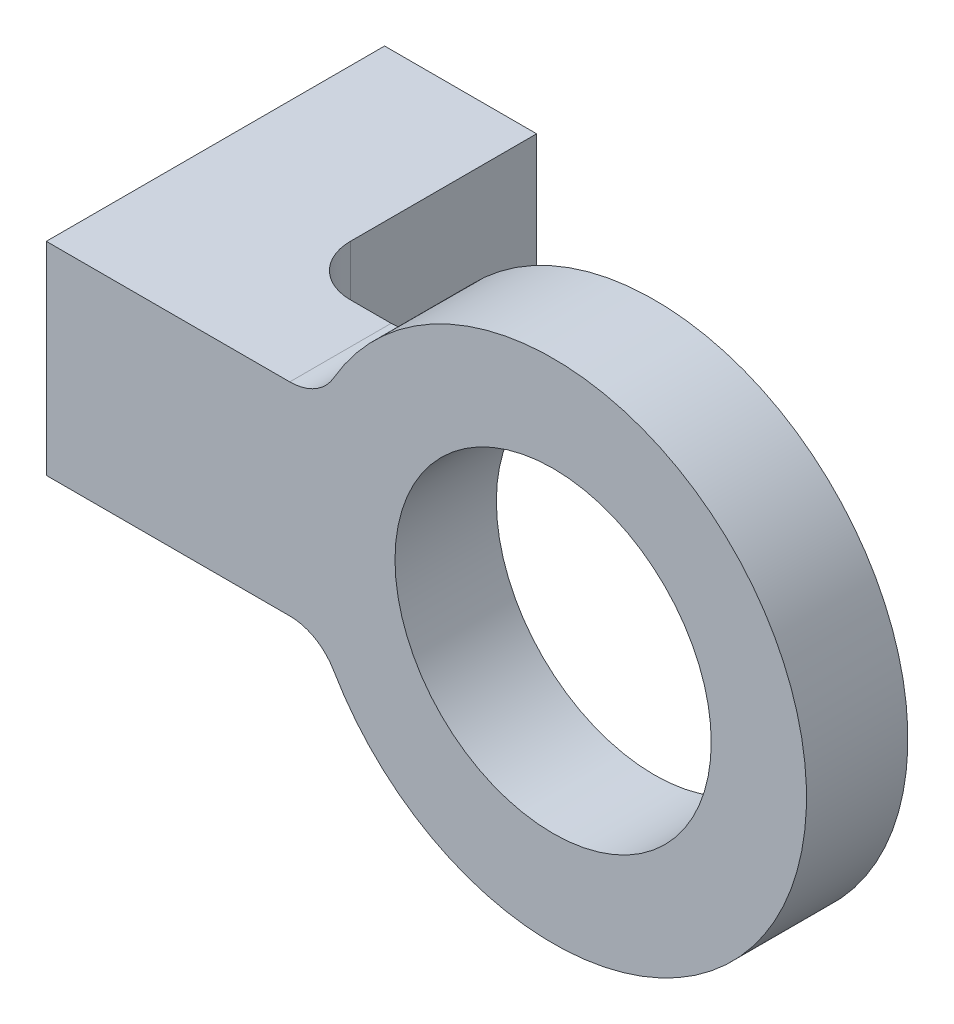
ISO-10303-21;
HEADER;
FILE_DESCRIPTION(('STEP AP214'),'2;1');
FILE_NAME('part.step','',(''),(''),'','','');
FILE_SCHEMA(('AUTOMOTIVE_DESIGN { 1 0 10303 214 1 1 1 1 }'));
ENDSEC;
DATA;
#1=APPLICATION_CONTEXT('core data for automotive mechanical design processes');
#2=APPLICATION_PROTOCOL_DEFINITION('international standard','automotive_design',2000,#1);
#3=PRODUCT_CONTEXT('',#1,'mechanical');
#4=PRODUCT('Part','Part','',(#3));
#5=PRODUCT_RELATED_PRODUCT_CATEGORY('part','',(#4));
#6=PRODUCT_DEFINITION_FORMATION('','',#4);
#7=PRODUCT_DEFINITION_CONTEXT('part definition',#1,'design');
#8=PRODUCT_DEFINITION('design','',#6,#7);
#9=PRODUCT_DEFINITION_SHAPE('','',#8);
#10=(LENGTH_UNIT() NAMED_UNIT(*) SI_UNIT(.MILLI.,.METRE.));
#11=(NAMED_UNIT(*) PLANE_ANGLE_UNIT() SI_UNIT($,.RADIAN.));
#12=(NAMED_UNIT(*) SI_UNIT($,.STERADIAN.) SOLID_ANGLE_UNIT());
#13=UNCERTAINTY_MEASURE_WITH_UNIT(LENGTH_MEASURE(1.E-05),#10,'distance_accuracy_value','');
#14=(GEOMETRIC_REPRESENTATION_CONTEXT(3) GLOBAL_UNCERTAINTY_ASSIGNED_CONTEXT((#13)) GLOBAL_UNIT_ASSIGNED_CONTEXT((#10,
#11,#12)) REPRESENTATION_CONTEXT('',''));
#15=CARTESIAN_POINT('',(0.,0.,0.));
#16=DIRECTION('',(0.,0.,1.));
#17=DIRECTION('',(1.,0.,0.));
#18=AXIS2_PLACEMENT_3D('',#15,#16,#17);
#19=CARTESIAN_POINT('',(22.225,6.35,6.35));
#20=DIRECTION('',(0.,0.,1.));
#21=DIRECTION('',(1.,0.,0.));
#22=AXIS2_PLACEMENT_3D('',#19,#20,#21);
#23=PLANE('',#22);
#24=DIRECTION('',(1.,0.,0.));
#25=VECTOR('',#24,1.);
#26=CARTESIAN_POINT('',(0.,0.,6.35));
#27=LINE('',#26,#25);
#28=CARTESIAN_POINT('',(-9.525,0.,6.35));
#29=VERTEX_POINT('',#28);
#30=CARTESIAN_POINT('',(5.72721605790644,0.,6.35));
#31=VERTEX_POINT('',#30);
#32=EDGE_CURVE('E167',#29,#31,#27,.T.);
#33=ORIENTED_EDGE('',*,*,#32,.T.);
#34=CARTESIAN_POINT('',(5.72721605790644,-3.175,6.35));
#35=DIRECTION('',(0.,0.,1.));
#36=DIRECTION('',(1.,0.,0.));
#37=AXIS2_PLACEMENT_3D('',#34,#35,#36);
#38=CIRCLE('',#37,3.175);
#39=CARTESIAN_POINT('',(8.47684671492204,-1.5875,6.35));
#40=VERTEX_POINT('',#39);
#41=EDGE_CURVE('E11',#31,#40,#38,.F.);
#42=ORIENTED_EDGE('',*,*,#41,.T.);
#43=CARTESIAN_POINT('',(22.225,6.35,6.35));
#44=DIRECTION('',(0.,0.,1.));
#45=DIRECTION('',(1.,0.,0.));
#46=AXIS2_PLACEMENT_3D('',#43,#44,#45);
#47=CIRCLE('',#46,15.875);
#48=CARTESIAN_POINT('',(8.47684671492204,14.2875,6.35));
#49=VERTEX_POINT('',#48);
#50=EDGE_CURVE('E162',#40,#49,#47,.T.);
#51=ORIENTED_EDGE('',*,*,#50,.T.);
#52=CARTESIAN_POINT('',(5.72721605790644,15.875,6.35));
#53=DIRECTION('',(0.,0.,1.));
#54=DIRECTION('',(1.,0.,0.));
#55=AXIS2_PLACEMENT_3D('',#52,#53,#54);
#56=CIRCLE('',#55,3.175);
#57=CARTESIAN_POINT('',(5.72721605790644,12.7,6.35));
#58=VERTEX_POINT('',#57);
#59=EDGE_CURVE('E196',#49,#58,#56,.F.);
#60=ORIENTED_EDGE('',*,*,#59,.T.);
#61=DIRECTION('',(-1.,0.,0.));
#62=VECTOR('',#61,1.);
#63=CARTESIAN_POINT('',(7.6753221685152,12.7,6.35));
#64=LINE('',#63,#62);
#65=CARTESIAN_POINT('',(-9.525,12.7,6.35));
#66=VERTEX_POINT('',#65);
#67=EDGE_CURVE('E164',#58,#66,#64,.T.);
#68=ORIENTED_EDGE('',*,*,#67,.T.);
#69=DIRECTION('',(0.,-1.,0.));
#70=VECTOR('',#69,1.);
#71=CARTESIAN_POINT('',(-9.525,12.7,6.35));
#72=LINE('',#71,#70);
#73=EDGE_CURVE('E121',#66,#29,#72,.T.);
#74=ORIENTED_EDGE('',*,*,#73,.T.);
#75=EDGE_LOOP('',(#33,#42,#51,#60,#68,#74));
#76=FACE_BOUND('',#75,.T.);
#77=CARTESIAN_POINT('',(22.225,6.35,6.35));
#78=DIRECTION('',(0.,0.,1.));
#79=DIRECTION('',(1.,0.,0.));
#80=AXIS2_PLACEMENT_3D('',#77,#78,#79);
#81=CIRCLE('',#80,9.90600000000001);
#82=CARTESIAN_POINT('',(32.131,6.35,6.35));
#83=VERTEX_POINT('',#82);
#84=EDGE_CURVE('E156',#83,#83,#81,.T.);
#85=ORIENTED_EDGE('',*,*,#84,.F.);
#86=EDGE_LOOP('',(#85));
#87=FACE_BOUND('',#86,.T.);
#88=ADVANCED_FACE('F37',(#76,#87),#23,.T.);
#89=CARTESIAN_POINT('',(22.225,6.35,0.));
#90=DIRECTION('',(0.,0.,1.));
#91=DIRECTION('',(1.,0.,0.));
#92=AXIS2_PLACEMENT_3D('',#89,#90,#91);
#93=PLANE('',#92);
#94=DIRECTION('',(1.,0.,0.));
#95=VECTOR('',#94,1.);
#96=CARTESIAN_POINT('',(0.,0.,0.));
#97=LINE('',#96,#95);
#98=CARTESIAN_POINT('',(3.175,0.,0.));
#99=VERTEX_POINT('',#98);
#100=CARTESIAN_POINT('',(5.72721605790644,0.,0.));
#101=VERTEX_POINT('',#100);
#102=EDGE_CURVE('E165',#99,#101,#97,.T.);
#103=ORIENTED_EDGE('',*,*,#102,.F.);
#104=DIRECTION('',(0.,-1.,0.));
#105=VECTOR('',#104,1.);
#106=CARTESIAN_POINT('',(3.175,6.35,0.));
#107=LINE('',#106,#105);
#108=CARTESIAN_POINT('',(3.175,12.7,0.));
#109=VERTEX_POINT('',#108);
#110=EDGE_CURVE('E180',#99,#109,#107,.F.);
#111=ORIENTED_EDGE('',*,*,#110,.T.);
#112=DIRECTION('',(-1.,0.,0.));
#113=VECTOR('',#112,1.);
#114=CARTESIAN_POINT('',(7.6753221685152,12.7,0.));
#115=LINE('',#114,#113);
#116=CARTESIAN_POINT('',(5.72721605790644,12.7,0.));
#117=VERTEX_POINT('',#116);
#118=EDGE_CURVE('E171',#117,#109,#115,.T.);
#119=ORIENTED_EDGE('',*,*,#118,.F.);
#120=CARTESIAN_POINT('',(5.72721605790644,15.875,0.));
#121=DIRECTION('',(0.,0.,1.));
#122=DIRECTION('',(1.,0.,0.));
#123=AXIS2_PLACEMENT_3D('',#120,#121,#122);
#124=CIRCLE('',#123,3.175);
#125=CARTESIAN_POINT('',(8.47684671492204,14.2875,0.));
#126=VERTEX_POINT('',#125);
#127=EDGE_CURVE('E194',#117,#126,#124,.T.);
#128=ORIENTED_EDGE('',*,*,#127,.T.);
#129=CARTESIAN_POINT('',(22.225,6.35,0.));
#130=DIRECTION('',(0.,0.,1.));
#131=DIRECTION('',(1.,0.,0.));
#132=AXIS2_PLACEMENT_3D('',#129,#130,#131);
#133=CIRCLE('',#132,15.875);
#134=CARTESIAN_POINT('',(8.47684671492204,-1.5875,0.));
#135=VERTEX_POINT('',#134);
#136=EDGE_CURVE('E159',#135,#126,#133,.T.);
#137=ORIENTED_EDGE('',*,*,#136,.F.);
#138=CARTESIAN_POINT('',(5.72721605790644,-3.175,0.));
#139=DIRECTION('',(0.,0.,1.));
#140=DIRECTION('',(1.,0.,0.));
#141=AXIS2_PLACEMENT_3D('',#138,#139,#140);
#142=CIRCLE('',#141,3.175);
#143=EDGE_CURVE('E45',#135,#101,#142,.T.);
#144=ORIENTED_EDGE('',*,*,#143,.T.);
#145=EDGE_LOOP('',(#103,#111,#119,#128,#137,#144));
#146=FACE_BOUND('',#145,.T.);
#147=CARTESIAN_POINT('',(22.225,6.35,0.));
#148=DIRECTION('',(0.,0.,1.));
#149=DIRECTION('',(1.,0.,0.));
#150=AXIS2_PLACEMENT_3D('',#147,#148,#149);
#151=CIRCLE('',#150,9.90600000000001);
#152=CARTESIAN_POINT('',(32.131,6.35,0.));
#153=VERTEX_POINT('',#152);
#154=EDGE_CURVE('E155',#153,#153,#151,.T.);
#155=ORIENTED_EDGE('',*,*,#154,.T.);
#156=EDGE_LOOP('',(#155));
#157=FACE_BOUND('',#156,.T.);
#158=ADVANCED_FACE('F200',(#146,#157),#93,.F.);
#159=CARTESIAN_POINT('',(22.225,6.35,6.35));
#160=DIRECTION('',(0.,0.,-1.));
#161=DIRECTION('',(-1.,0.,0.));
#162=AXIS2_PLACEMENT_3D('',#159,#160,#161);
#163=CYLINDRICAL_SURFACE('',#162,15.875);
#164=ORIENTED_EDGE('',*,*,#136,.T.);
#165=DIRECTION('',(0.,0.,-1.));
#166=VECTOR('',#165,1.);
#167=CARTESIAN_POINT('',(8.47684671492203,14.2875,6.35));
#168=LINE('',#167,#166);
#169=EDGE_CURVE('E60',#126,#49,#168,.F.);
#170=ORIENTED_EDGE('',*,*,#169,.T.);
#171=ORIENTED_EDGE('',*,*,#50,.F.);
#172=DIRECTION('',(0.,0.,-1.));
#173=VECTOR('',#172,1.);
#174=CARTESIAN_POINT('',(8.47684671492203,-1.5875,6.35));
#175=LINE('',#174,#173);
#176=EDGE_CURVE('E185',#40,#135,#175,.T.);
#177=ORIENTED_EDGE('',*,*,#176,.T.);
#178=EDGE_LOOP('',(#164,#170,#171,#177));
#179=FACE_BOUND('',#178,.T.);
#180=ADVANCED_FACE('F210',(#179),#163,.T.);
#181=CARTESIAN_POINT('',(7.6753221685152,12.7,6.35));
#182=DIRECTION('',(0.,-1.,0.));
#183=DIRECTION('',(1.,0.,0.));
#184=AXIS2_PLACEMENT_3D('',#181,#182,#183);
#185=PLANE('',#184);
#186=ORIENTED_EDGE('',*,*,#67,.F.);
#187=DIRECTION('',(0.,0.,1.));
#188=VECTOR('',#187,1.);
#189=CARTESIAN_POINT('',(5.72721605790644,12.7,0.));
#190=LINE('',#189,#188);
#191=EDGE_CURVE('E182',#58,#117,#190,.F.);
#192=ORIENTED_EDGE('',*,*,#191,.T.);
#193=ORIENTED_EDGE('',*,*,#118,.T.);
#194=CARTESIAN_POINT('',(3.175,12.7,-3.175));
#195=DIRECTION('',(0.,-1.,0.));
#196=DIRECTION('',(1.,0.,0.));
#197=AXIS2_PLACEMENT_3D('',#194,#195,#196);
#198=CIRCLE('',#197,3.175);
#199=CARTESIAN_POINT('',(0.,12.7,-3.175));
#200=VERTEX_POINT('',#199);
#201=EDGE_CURVE('E192',#109,#200,#198,.T.);
#202=ORIENTED_EDGE('',*,*,#201,.T.);
#203=DIRECTION('',(0.,0.,1.));
#204=VECTOR('',#203,1.);
#205=CARTESIAN_POINT('',(0.,12.7,-30.718));
#206=LINE('',#205,#204);
#207=CARTESIAN_POINT('',(0.,12.7,-14.843));
#208=VERTEX_POINT('',#207);
#209=EDGE_CURVE('E136',#208,#200,#206,.T.);
#210=ORIENTED_EDGE('',*,*,#209,.F.);
#211=DIRECTION('',(-1.,0.,0.));
#212=VECTOR('',#211,1.);
#213=CARTESIAN_POINT('',(0.,12.7,-14.843));
#214=LINE('',#213,#212);
#215=CARTESIAN_POINT('',(-9.525,12.7,-14.843));
#216=VERTEX_POINT('',#215);
#217=EDGE_CURVE('E125',#208,#216,#214,.T.);
#218=ORIENTED_EDGE('',*,*,#217,.T.);
#219=DIRECTION('',(0.,0.,1.));
#220=VECTOR('',#219,1.);
#221=CARTESIAN_POINT('',(-9.525,12.7,-30.718));
#222=LINE('',#221,#220);
#223=EDGE_CURVE('E132',#216,#66,#222,.T.);
#224=ORIENTED_EDGE('',*,*,#223,.T.);
#225=EDGE_LOOP('',(#186,#192,#193,#202,#210,#218,#224));
#226=FACE_BOUND('',#225,.T.);
#227=ADVANCED_FACE('F217',(#226),#185,.F.);
#228=CARTESIAN_POINT('',(0.,0.,6.35));
#229=DIRECTION('',(0.,1.,0.));
#230=DIRECTION('',(0.,0.,1.));
#231=AXIS2_PLACEMENT_3D('',#228,#229,#230);
#232=PLANE('',#231);
#233=ORIENTED_EDGE('',*,*,#102,.T.);
#234=DIRECTION('',(0.,0.,1.));
#235=VECTOR('',#234,1.);
#236=CARTESIAN_POINT('',(5.72721605790644,0.,6.35));
#237=LINE('',#236,#235);
#238=EDGE_CURVE('E52',#101,#31,#237,.T.);
#239=ORIENTED_EDGE('',*,*,#238,.T.);
#240=ORIENTED_EDGE('',*,*,#32,.F.);
#241=DIRECTION('',(0.,0.,1.));
#242=VECTOR('',#241,1.);
#243=CARTESIAN_POINT('',(-9.525,0.,-30.718));
#244=LINE('',#243,#242);
#245=CARTESIAN_POINT('',(-9.525,0.,-14.843));
#246=VERTEX_POINT('',#245);
#247=EDGE_CURVE('E141',#246,#29,#244,.T.);
#248=ORIENTED_EDGE('',*,*,#247,.F.);
#249=DIRECTION('',(1.,0.,0.));
#250=VECTOR('',#249,1.);
#251=CARTESIAN_POINT('',(0.,0.,-14.843));
#252=LINE('',#251,#250);
#253=CARTESIAN_POINT('',(0.,0.,-14.843));
#254=VERTEX_POINT('',#253);
#255=EDGE_CURVE('E138',#246,#254,#252,.T.);
#256=ORIENTED_EDGE('',*,*,#255,.T.);
#257=DIRECTION('',(0.,0.,1.));
#258=VECTOR('',#257,1.);
#259=CARTESIAN_POINT('',(0.,0.,-30.718));
#260=LINE('',#259,#258);
#261=CARTESIAN_POINT('',(0.,0.,-3.175));
#262=VERTEX_POINT('',#261);
#263=EDGE_CURVE('E137',#254,#262,#260,.T.);
#264=ORIENTED_EDGE('',*,*,#263,.T.);
#265=CARTESIAN_POINT('',(3.175,0.,-3.175));
#266=DIRECTION('',(0.,1.,0.));
#267=DIRECTION('',(0.,0.,1.));
#268=AXIS2_PLACEMENT_3D('',#265,#266,#267);
#269=CIRCLE('',#268,3.175);
#270=EDGE_CURVE('E190',#262,#99,#269,.T.);
#271=ORIENTED_EDGE('',*,*,#270,.T.);
#272=EDGE_LOOP('',(#233,#239,#240,#248,#256,#264,#271));
#273=FACE_BOUND('',#272,.T.);
#274=ADVANCED_FACE('F205',(#273),#232,.F.);
#275=CARTESIAN_POINT('',(22.225,6.35,6.35));
#276=DIRECTION('',(0.,0.,-1.));
#277=DIRECTION('',(-1.,0.,0.));
#278=AXIS2_PLACEMENT_3D('',#275,#276,#277);
#279=CYLINDRICAL_SURFACE('',#278,9.90600000000001);
#280=ORIENTED_EDGE('',*,*,#84,.T.);
#281=EDGE_LOOP('',(#280));
#282=FACE_BOUND('',#281,.T.);
#283=ORIENTED_EDGE('',*,*,#154,.F.);
#284=EDGE_LOOP('',(#283));
#285=FACE_BOUND('',#284,.T.);
#286=ADVANCED_FACE('F250',(#282,#285),#279,.F.);
#287=CARTESIAN_POINT('',(-39.962398,234.95,-14.843));
#288=DIRECTION('',(0.,0.,-1.));
#289=DIRECTION('',(0.,1.,0.));
#290=AXIS2_PLACEMENT_3D('',#287,#288,#289);
#291=PLANE('',#290);
#292=CARTESIAN_POINT('',(-4.7625,6.35,-14.843));
#293=DIRECTION('',(0.,0.,-1.));
#294=DIRECTION('',(-1.,0.,0.));
#295=AXIS2_PLACEMENT_3D('',#292,#293,#294);
#296=CIRCLE('',#295,1.72719999999999);
#297=CARTESIAN_POINT('',(-6.48969999999999,6.35,-14.843));
#298=VERTEX_POINT('',#297);
#299=EDGE_CURVE('E122',#298,#298,#296,.T.);
#300=ORIENTED_EDGE('',*,*,#299,.F.);
#301=EDGE_LOOP('',(#300));
#302=FACE_BOUND('',#301,.T.);
#303=DIRECTION('',(0.,1.,0.));
#304=VECTOR('',#303,1.);
#305=CARTESIAN_POINT('',(0.,12.7,-14.843));
#306=LINE('',#305,#304);
#307=EDGE_CURVE('E133',#254,#208,#306,.T.);
#308=ORIENTED_EDGE('',*,*,#307,.F.);
#309=ORIENTED_EDGE('',*,*,#255,.F.);
#310=DIRECTION('',(0.,-1.,0.));
#311=VECTOR('',#310,1.);
#312=CARTESIAN_POINT('',(-9.525,12.7,-14.843));
#313=LINE('',#312,#311);
#314=EDGE_CURVE('E142',#216,#246,#313,.T.);
#315=ORIENTED_EDGE('',*,*,#314,.F.);
#316=ORIENTED_EDGE('',*,*,#217,.F.);
#317=EDGE_LOOP('',(#308,#309,#315,#316));
#318=FACE_BOUND('',#317,.T.);
#319=ADVANCED_FACE('F228',(#302,#318),#291,.T.);
#320=CARTESIAN_POINT('',(-9.525,12.7,-30.718));
#321=DIRECTION('',(-1.,0.,0.));
#322=DIRECTION('',(0.,-1.,0.));
#323=AXIS2_PLACEMENT_3D('',#320,#321,#322);
#324=PLANE('',#323);
#325=ORIENTED_EDGE('',*,*,#223,.F.);
#326=ORIENTED_EDGE('',*,*,#314,.T.);
#327=ORIENTED_EDGE('',*,*,#247,.T.);
#328=ORIENTED_EDGE('',*,*,#73,.F.);
#329=EDGE_LOOP('',(#325,#326,#327,#328));
#330=FACE_BOUND('',#329,.T.);
#331=ADVANCED_FACE('F224',(#330),#324,.T.);
#332=CARTESIAN_POINT('',(0.,12.7,-30.718));
#333=DIRECTION('',(1.,0.,0.));
#334=DIRECTION('',(0.,1.,0.));
#335=AXIS2_PLACEMENT_3D('',#332,#333,#334);
#336=PLANE('',#335);
#337=ORIENTED_EDGE('',*,*,#209,.T.);
#338=DIRECTION('',(0.,-1.,0.));
#339=VECTOR('',#338,1.);
#340=CARTESIAN_POINT('',(0.,12.7,-3.175));
#341=LINE('',#340,#339);
#342=EDGE_CURVE('E169',#200,#262,#341,.T.);
#343=ORIENTED_EDGE('',*,*,#342,.T.);
#344=ORIENTED_EDGE('',*,*,#263,.F.);
#345=ORIENTED_EDGE('',*,*,#307,.T.);
#346=EDGE_LOOP('',(#337,#343,#344,#345));
#347=FACE_BOUND('',#346,.T.);
#348=ADVANCED_FACE('F115',(#347),#336,.T.);
#349=CARTESIAN_POINT('',(-4.7625,6.35,2.01243999999999));
#350=DIRECTION('',(0.,0.,-1.));
#351=DIRECTION('',(-1.,0.,0.));
#352=AXIS2_PLACEMENT_3D('',#349,#350,#351);
#353=CONICAL_SURFACE('',#352,1.7272,1.02974425867665);
#354=CARTESIAN_POINT('',(-4.7625,6.35,3.05024646118439));
#355=VERTEX_POINT('',#354);
#356=VERTEX_LOOP('',#355);
#357=FACE_BOUND('',#356,.T.);
#358=CARTESIAN_POINT('',(-4.7625,6.35,2.01243999999999));
#359=DIRECTION('',(0.,0.,-1.));
#360=DIRECTION('',(-1.,0.,0.));
#361=AXIS2_PLACEMENT_3D('',#358,#359,#360);
#362=CIRCLE('',#361,1.7272);
#363=CARTESIAN_POINT('',(-6.48969999999999,6.35,2.01243999999999));
#364=VERTEX_POINT('',#363);
#365=EDGE_CURVE('E119',#364,#364,#362,.T.);
#366=ORIENTED_EDGE('',*,*,#365,.T.);
#367=EDGE_LOOP('',(#366));
#368=FACE_BOUND('',#367,.T.);
#369=ADVANCED_FACE('F111',(#357,#368),#353,.F.);
#370=CARTESIAN_POINT('',(-4.7625,6.35,-14.843));
#371=DIRECTION('',(0.,0.,-1.));
#372=DIRECTION('',(-1.,0.,0.));
#373=AXIS2_PLACEMENT_3D('',#370,#371,#372);
#374=CYLINDRICAL_SURFACE('',#373,1.72719999999999);
#375=ORIENTED_EDGE('',*,*,#365,.F.);
#376=EDGE_LOOP('',(#375));
#377=FACE_BOUND('',#376,.T.);
#378=ORIENTED_EDGE('',*,*,#299,.T.);
#379=EDGE_LOOP('',(#378));
#380=FACE_BOUND('',#379,.T.);
#381=ADVANCED_FACE('F114',(#377,#380),#374,.F.);
#382=CARTESIAN_POINT('',(3.175,12.7,-3.175));
#383=DIRECTION('',(0.,-1.,0.));
#384=DIRECTION('',(1.,0.,0.));
#385=AXIS2_PLACEMENT_3D('',#382,#383,#384);
#386=CYLINDRICAL_SURFACE('',#385,3.175);
#387=ORIENTED_EDGE('',*,*,#201,.F.);
#388=ORIENTED_EDGE('',*,*,#110,.F.);
#389=ORIENTED_EDGE('',*,*,#270,.F.);
#390=ORIENTED_EDGE('',*,*,#342,.F.);
#391=EDGE_LOOP('',(#387,#388,#389,#390));
#392=FACE_BOUND('',#391,.T.);
#393=ADVANCED_FACE('F234',(#392),#386,.F.);
#394=CARTESIAN_POINT('',(5.72721605790644,15.875,6.35));
#395=DIRECTION('',(0.,0.,-1.));
#396=DIRECTION('',(-1.,0.,0.));
#397=AXIS2_PLACEMENT_3D('',#394,#395,#396);
#398=CYLINDRICAL_SURFACE('',#397,3.175);
#399=ORIENTED_EDGE('',*,*,#59,.F.);
#400=ORIENTED_EDGE('',*,*,#169,.F.);
#401=ORIENTED_EDGE('',*,*,#127,.F.);
#402=ORIENTED_EDGE('',*,*,#191,.F.);
#403=EDGE_LOOP('',(#399,#400,#401,#402));
#404=FACE_BOUND('',#403,.T.);
#405=ADVANCED_FACE('F212',(#404),#398,.F.);
#406=CARTESIAN_POINT('',(5.72721605790644,-3.175,6.35));
#407=DIRECTION('',(0.,0.,-1.));
#408=DIRECTION('',(-1.,0.,0.));
#409=AXIS2_PLACEMENT_3D('',#406,#407,#408);
#410=CYLINDRICAL_SURFACE('',#409,3.175);
#411=ORIENTED_EDGE('',*,*,#41,.F.);
#412=ORIENTED_EDGE('',*,*,#238,.F.);
#413=ORIENTED_EDGE('',*,*,#143,.F.);
#414=ORIENTED_EDGE('',*,*,#176,.F.);
#415=EDGE_LOOP('',(#411,#412,#413,#414));
#416=FACE_BOUND('',#415,.T.);
#417=ADVANCED_FACE('F39',(#416),#410,.F.);
#418=CLOSED_SHELL('',(#88,#158,#180,#227,#274,#286,#319,#331,#348,#369,#381,#393,#405,#417));
#419=MANIFOLD_SOLID_BREP('B2',#418);
#420=ADVANCED_BREP_SHAPE_REPRESENTATION('',(#18,#419),#14);
#421=SHAPE_DEFINITION_REPRESENTATION(#9,#420);
ENDSEC;
END-ISO-10303-21;
